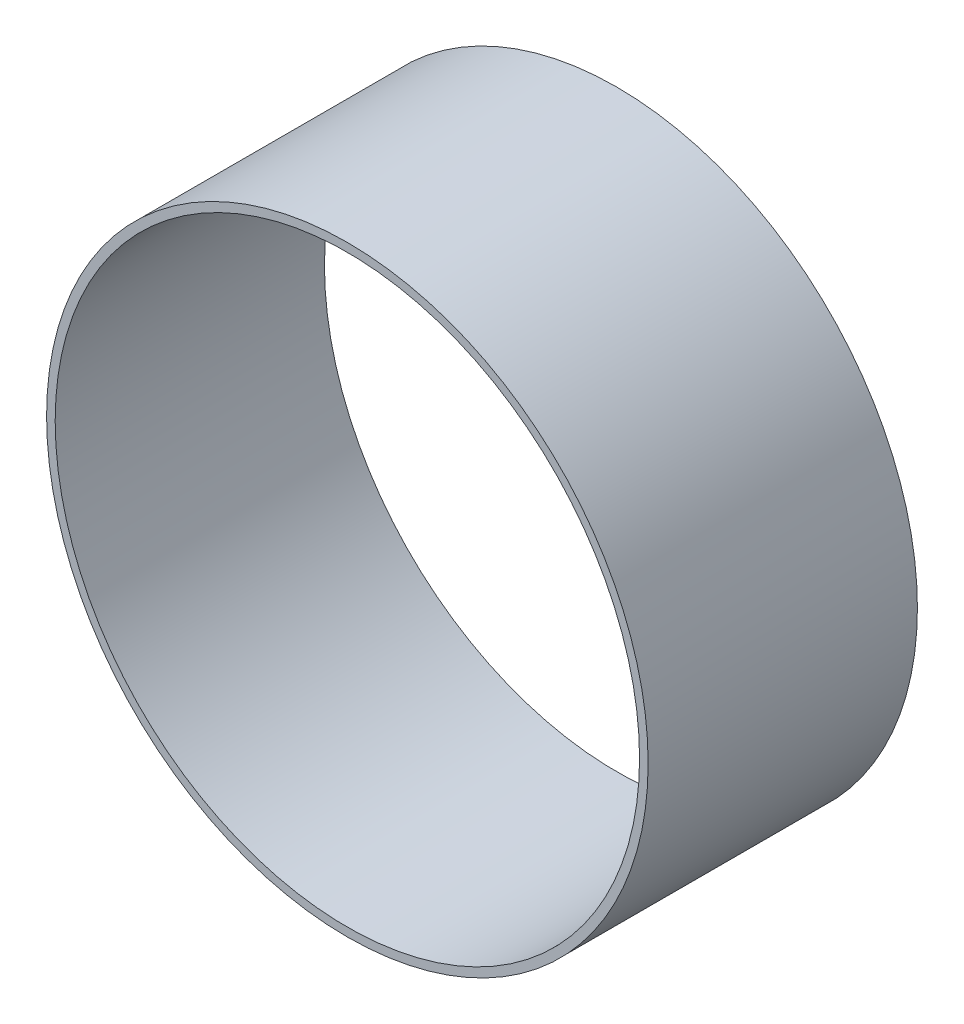
ISO-10303-21;
HEADER;
FILE_DESCRIPTION(('STEP AP214'),'2;1');
FILE_NAME('part.step','',(''),(''),'','','');
FILE_SCHEMA(('AUTOMOTIVE_DESIGN { 1 0 10303 214 1 1 1 1 }'));
ENDSEC;
DATA;
#1=APPLICATION_CONTEXT('core data for automotive mechanical design processes');
#2=APPLICATION_PROTOCOL_DEFINITION('international standard','automotive_design',2000,#1);
#3=PRODUCT_CONTEXT('',#1,'mechanical');
#4=PRODUCT('Part','Part','',(#3));
#5=PRODUCT_RELATED_PRODUCT_CATEGORY('part','',(#4));
#6=PRODUCT_DEFINITION_FORMATION('','',#4);
#7=PRODUCT_DEFINITION_CONTEXT('part definition',#1,'design');
#8=PRODUCT_DEFINITION('design','',#6,#7);
#9=PRODUCT_DEFINITION_SHAPE('','',#8);
#10=(LENGTH_UNIT() NAMED_UNIT(*) SI_UNIT(.MILLI.,.METRE.));
#11=(NAMED_UNIT(*) PLANE_ANGLE_UNIT() SI_UNIT($,.RADIAN.));
#12=(NAMED_UNIT(*) SI_UNIT($,.STERADIAN.) SOLID_ANGLE_UNIT());
#13=UNCERTAINTY_MEASURE_WITH_UNIT(LENGTH_MEASURE(1.E-05),#10,'distance_accuracy_value','');
#14=(GEOMETRIC_REPRESENTATION_CONTEXT(3) GLOBAL_UNCERTAINTY_ASSIGNED_CONTEXT((#13)) GLOBAL_UNIT_ASSIGNED_CONTEXT((#10,
#11,#12)) REPRESENTATION_CONTEXT('',''));
#15=CARTESIAN_POINT('',(0.,0.,0.));
#16=DIRECTION('',(0.,0.,1.));
#17=DIRECTION('',(1.,0.,0.));
#18=AXIS2_PLACEMENT_3D('',#15,#16,#17);
#19=CARTESIAN_POINT('',(0.,0.,74.6125));
#20=DIRECTION('',(0.,0.,1.));
#21=DIRECTION('',(1.,0.,0.));
#22=AXIS2_PLACEMENT_3D('',#19,#20,#21);
#23=PLANE('',#22);
#24=CARTESIAN_POINT('',(0.,0.,74.6125));
#25=DIRECTION('',(0.,0.,1.));
#26=DIRECTION('',(1.,0.,0.));
#27=AXIS2_PLACEMENT_3D('',#24,#25,#26);
#28=CIRCLE('',#27,166.6875);
#29=CARTESIAN_POINT('',(166.6875,0.,74.6125));
#30=VERTEX_POINT('',#29);
#31=EDGE_CURVE('E10',#30,#30,#28,.T.);
#32=ORIENTED_EDGE('',*,*,#31,.T.);
#33=EDGE_LOOP('',(#32));
#34=FACE_BOUND('',#33,.T.);
#35=CARTESIAN_POINT('',(0.,0.,74.6125));
#36=DIRECTION('',(0.,0.,1.));
#37=DIRECTION('',(1.,0.,0.));
#38=AXIS2_PLACEMENT_3D('',#35,#36,#37);
#39=CIRCLE('',#38,161.925);
#40=CARTESIAN_POINT('',(161.925,0.,74.6125));
#41=VERTEX_POINT('',#40);
#42=EDGE_CURVE('E45',#41,#41,#39,.T.);
#43=ORIENTED_EDGE('',*,*,#42,.F.);
#44=EDGE_LOOP('',(#43));
#45=FACE_BOUND('',#44,.T.);
#46=ADVANCED_FACE('F34',(#34,#45),#23,.T.);
#47=CARTESIAN_POINT('',(0.,0.,-74.6125));
#48=DIRECTION('',(0.,0.,1.));
#49=DIRECTION('',(1.,0.,0.));
#50=AXIS2_PLACEMENT_3D('',#47,#48,#49);
#51=PLANE('',#50);
#52=CARTESIAN_POINT('',(0.,0.,-74.6125));
#53=DIRECTION('',(0.,0.,1.));
#54=DIRECTION('',(1.,0.,0.));
#55=AXIS2_PLACEMENT_3D('',#52,#53,#54);
#56=CIRCLE('',#55,166.6875);
#57=CARTESIAN_POINT('',(166.6875,0.,-74.6125));
#58=VERTEX_POINT('',#57);
#59=EDGE_CURVE('E38',#58,#58,#56,.T.);
#60=ORIENTED_EDGE('',*,*,#59,.F.);
#61=EDGE_LOOP('',(#60));
#62=FACE_BOUND('',#61,.T.);
#63=CARTESIAN_POINT('',(0.,0.,-74.6125));
#64=DIRECTION('',(0.,0.,1.));
#65=DIRECTION('',(1.,0.,0.));
#66=AXIS2_PLACEMENT_3D('',#63,#64,#65);
#67=CIRCLE('',#66,161.925);
#68=CARTESIAN_POINT('',(161.925,0.,-74.6125));
#69=VERTEX_POINT('',#68);
#70=EDGE_CURVE('E47',#69,#69,#67,.T.);
#71=ORIENTED_EDGE('',*,*,#70,.T.);
#72=EDGE_LOOP('',(#71));
#73=FACE_BOUND('',#72,.T.);
#74=ADVANCED_FACE('F57',(#62,#73),#51,.F.);
#75=CARTESIAN_POINT('',(0.,0.,74.6125));
#76=DIRECTION('',(0.,0.,-1.));
#77=DIRECTION('',(-1.,0.,0.));
#78=AXIS2_PLACEMENT_3D('',#75,#76,#77);
#79=CYLINDRICAL_SURFACE('',#78,166.6875);
#80=ORIENTED_EDGE('',*,*,#31,.F.);
#81=EDGE_LOOP('',(#80));
#82=FACE_BOUND('',#81,.T.);
#83=ORIENTED_EDGE('',*,*,#59,.T.);
#84=EDGE_LOOP('',(#83));
#85=FACE_BOUND('',#84,.T.);
#86=ADVANCED_FACE('F36',(#82,#85),#79,.T.);
#87=CARTESIAN_POINT('',(0.,0.,74.6125));
#88=DIRECTION('',(0.,0.,-1.));
#89=DIRECTION('',(-1.,0.,0.));
#90=AXIS2_PLACEMENT_3D('',#87,#88,#89);
#91=CYLINDRICAL_SURFACE('',#90,161.925);
#92=ORIENTED_EDGE('',*,*,#42,.T.);
#93=EDGE_LOOP('',(#92));
#94=FACE_BOUND('',#93,.T.);
#95=ORIENTED_EDGE('',*,*,#70,.F.);
#96=EDGE_LOOP('',(#95));
#97=FACE_BOUND('',#96,.T.);
#98=ADVANCED_FACE('F53',(#94,#97),#91,.F.);
#99=CLOSED_SHELL('',(#46,#74,#86,#98));
#100=MANIFOLD_SOLID_BREP('B2',#99);
#101=ADVANCED_BREP_SHAPE_REPRESENTATION('',(#18,#100),#14);
#102=SHAPE_DEFINITION_REPRESENTATION(#9,#101);
ENDSEC;
END-ISO-10303-21;
